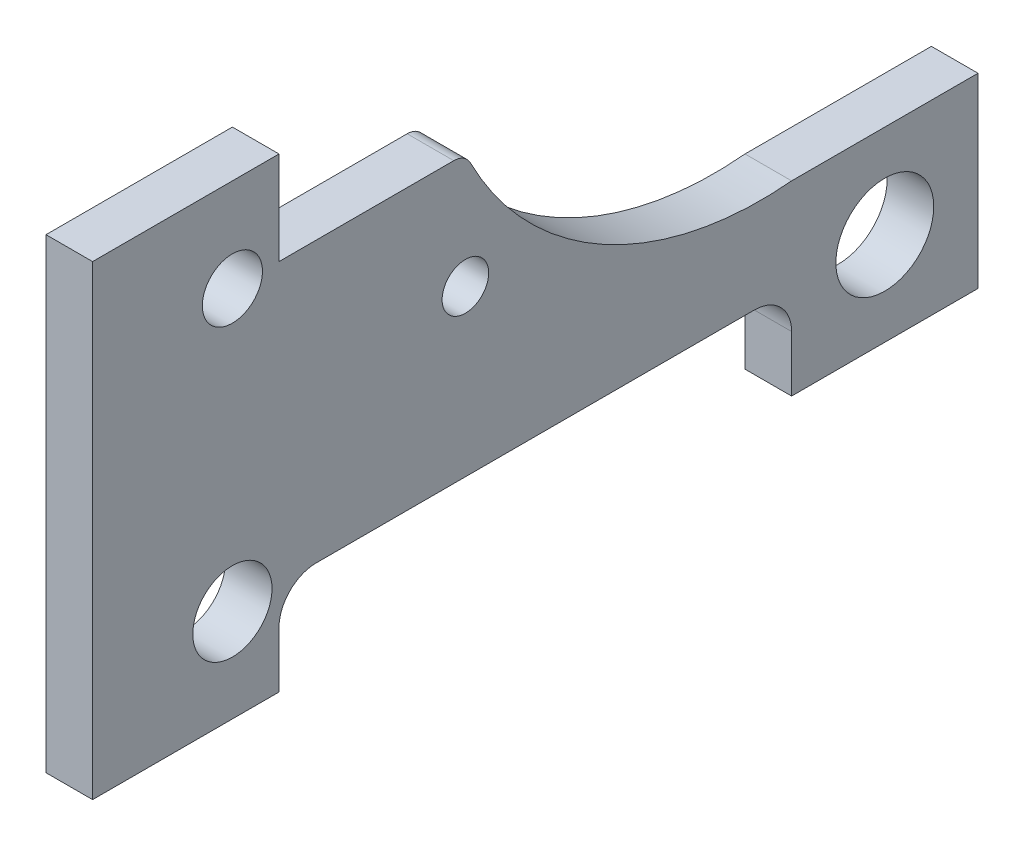
ISO-10303-21;
HEADER;
FILE_DESCRIPTION(('STEP AP214'),'2;1');
FILE_NAME('part.step','',(''),(''),'','','');
FILE_SCHEMA(('AUTOMOTIVE_DESIGN { 1 0 10303 214 1 1 1 1 }'));
ENDSEC;
DATA;
#1=APPLICATION_CONTEXT('core data for automotive mechanical design processes');
#2=APPLICATION_PROTOCOL_DEFINITION('international standard','automotive_design',2000,#1);
#3=PRODUCT_CONTEXT('',#1,'mechanical');
#4=PRODUCT('Part','Part','',(#3));
#5=PRODUCT_RELATED_PRODUCT_CATEGORY('part','',(#4));
#6=PRODUCT_DEFINITION_FORMATION('','',#4);
#7=PRODUCT_DEFINITION_CONTEXT('part definition',#1,'design');
#8=PRODUCT_DEFINITION('design','',#6,#7);
#9=PRODUCT_DEFINITION_SHAPE('','',#8);
#10=(LENGTH_UNIT() NAMED_UNIT(*) SI_UNIT(.MILLI.,.METRE.));
#11=(NAMED_UNIT(*) PLANE_ANGLE_UNIT() SI_UNIT($,.RADIAN.));
#12=(NAMED_UNIT(*) SI_UNIT($,.STERADIAN.) SOLID_ANGLE_UNIT());
#13=UNCERTAINTY_MEASURE_WITH_UNIT(LENGTH_MEASURE(1.E-05),#10,'distance_accuracy_value','');
#14=(GEOMETRIC_REPRESENTATION_CONTEXT(3) GLOBAL_UNCERTAINTY_ASSIGNED_CONTEXT((#13)) GLOBAL_UNIT_ASSIGNED_CONTEXT((#10,
#11,#12)) REPRESENTATION_CONTEXT('',''));
#15=CARTESIAN_POINT('',(0.,0.,0.));
#16=DIRECTION('',(0.,0.,1.));
#17=DIRECTION('',(1.,0.,0.));
#18=AXIS2_PLACEMENT_3D('',#15,#16,#17);
#19=CARTESIAN_POINT('',(5.,54.8437424407342,-71.6964242518481));
#20=DIRECTION('',(1.,0.,0.));
#21=DIRECTION('',(0.,0.,-1.));
#22=AXIS2_PLACEMENT_3D('',#19,#20,#21);
#23=PLANE('',#22);
#24=CARTESIAN_POINT('',(5.,27.7000519533061,-40.));
#25=DIRECTION('',(1.,0.,0.));
#26=DIRECTION('',(0.,0.,-1.));
#27=AXIS2_PLACEMENT_3D('',#24,#25,#26);
#28=CIRCLE('',#27,2.5);
#29=CARTESIAN_POINT('',(5.,27.7000519533061,-42.5));
#30=VERTEX_POINT('',#29);
#31=EDGE_CURVE('E494',#30,#30,#28,.T.);
#32=ORIENTED_EDGE('',*,*,#31,.F.);
#33=EDGE_LOOP('',(#32));
#34=FACE_BOUND('',#33,.T.);
#35=CARTESIAN_POINT('',(5.,40.,-15.));
#36=DIRECTION('',(1.,0.,0.));
#37=DIRECTION('',(0.,0.,-1.));
#38=AXIS2_PLACEMENT_3D('',#35,#36,#37);
#39=CIRCLE('',#38,3.225);
#40=CARTESIAN_POINT('',(5.,40.,-18.225));
#41=VERTEX_POINT('',#40);
#42=EDGE_CURVE('E270',#41,#41,#39,.T.);
#43=ORIENTED_EDGE('',*,*,#42,.F.);
#44=EDGE_LOOP('',(#43));
#45=FACE_BOUND('',#44,.T.);
#46=CARTESIAN_POINT('',(5.,54.8437424407342,-71.6964242518481));
#47=DIRECTION('',(-1.,0.,0.));
#48=DIRECTION('',(0.,0.,-1.));
#49=AXIS2_PLACEMENT_3D('',#46,#47,#48);
#50=CIRCLE('',#49,35.);
#51=CARTESIAN_POINT('',(5.,20.,-75.));
#52=VERTEX_POINT('',#51);
#53=CARTESIAN_POINT('',(5.,38.910472564364,-40.5334508531695));
#54=VERTEX_POINT('',#53);
#55=EDGE_CURVE('E257',#52,#54,#50,.T.);
#56=ORIENTED_EDGE('',*,*,#55,.T.);
#57=CARTESIAN_POINT('',(5.,38.,-38.7527095161021));
#58=DIRECTION('',(1.,0.,0.));
#59=DIRECTION('',(0.,0.,-1.));
#60=AXIS2_PLACEMENT_3D('',#57,#58,#59);
#61=CIRCLE('',#60,2.);
#62=CARTESIAN_POINT('',(5.,40.,-38.7527095161021));
#63=VERTEX_POINT('',#62);
#64=EDGE_CURVE('E11',#54,#63,#61,.T.);
#65=ORIENTED_EDGE('',*,*,#64,.T.);
#66=DIRECTION('',(0.,0.,1.));
#67=VECTOR('',#66,1.);
#68=CARTESIAN_POINT('',(5.,40.,-20.));
#69=LINE('',#68,#67);
#70=CARTESIAN_POINT('',(5.,40.,-20.));
#71=VERTEX_POINT('',#70);
#72=EDGE_CURVE('E199',#63,#71,#69,.T.);
#73=ORIENTED_EDGE('',*,*,#72,.T.);
#74=DIRECTION('',(0.,1.,0.));
#75=VECTOR('',#74,1.);
#76=CARTESIAN_POINT('',(5.,50.,-20.));
#77=LINE('',#76,#75);
#78=CARTESIAN_POINT('',(5.,50.,-20.));
#79=VERTEX_POINT('',#78);
#80=EDGE_CURVE('E260',#71,#79,#77,.T.);
#81=ORIENTED_EDGE('',*,*,#80,.T.);
#82=DIRECTION('',(0.,0.,1.));
#83=VECTOR('',#82,1.);
#84=CARTESIAN_POINT('',(5.,50.,0.));
#85=LINE('',#84,#83);
#86=CARTESIAN_POINT('',(5.,50.,0.));
#87=VERTEX_POINT('',#86);
#88=EDGE_CURVE('E157',#79,#87,#85,.T.);
#89=ORIENTED_EDGE('',*,*,#88,.T.);
#90=DIRECTION('',(0.,-1.,0.));
#91=VECTOR('',#90,1.);
#92=CARTESIAN_POINT('',(5.,0.,0.));
#93=LINE('',#92,#91);
#94=CARTESIAN_POINT('',(5.,0.,0.));
#95=VERTEX_POINT('',#94);
#96=EDGE_CURVE('E152',#87,#95,#93,.T.);
#97=ORIENTED_EDGE('',*,*,#96,.T.);
#98=DIRECTION('',(0.,0.,-1.));
#99=VECTOR('',#98,1.);
#100=CARTESIAN_POINT('',(5.,0.,0.));
#101=LINE('',#100,#99);
#102=CARTESIAN_POINT('',(5.,0.,-20.));
#103=VERTEX_POINT('',#102);
#104=EDGE_CURVE('E140',#95,#103,#101,.T.);
#105=ORIENTED_EDGE('',*,*,#104,.T.);
#106=DIRECTION('',(0.,1.,0.));
#107=VECTOR('',#106,1.);
#108=CARTESIAN_POINT('',(5.,0.,-20.));
#109=LINE('',#108,#107);
#110=CARTESIAN_POINT('',(5.,5.99999999999999,-20.));
#111=VERTEX_POINT('',#110);
#112=EDGE_CURVE('E151',#103,#111,#109,.T.);
#113=ORIENTED_EDGE('',*,*,#112,.T.);
#114=CARTESIAN_POINT('',(5.,6.,-24.));
#115=DIRECTION('',(1.,0.,0.));
#116=DIRECTION('',(0.,0.,-1.));
#117=AXIS2_PLACEMENT_3D('',#114,#115,#116);
#118=CIRCLE('',#117,4.);
#119=CARTESIAN_POINT('',(5.,10.,-24.));
#120=VERTEX_POINT('',#119);
#121=EDGE_CURVE('E187',#111,#120,#118,.F.);
#122=ORIENTED_EDGE('',*,*,#121,.T.);
#123=DIRECTION('',(0.,0.,-1.));
#124=VECTOR('',#123,1.);
#125=CARTESIAN_POINT('',(5.,10.,-20.));
#126=LINE('',#125,#124);
#127=CARTESIAN_POINT('',(5.,10.,-71.));
#128=VERTEX_POINT('',#127);
#129=EDGE_CURVE('E287',#120,#128,#126,.T.);
#130=ORIENTED_EDGE('',*,*,#129,.T.);
#131=CARTESIAN_POINT('',(5.,6.,-71.));
#132=DIRECTION('',(1.,0.,0.));
#133=DIRECTION('',(0.,0.,-1.));
#134=AXIS2_PLACEMENT_3D('',#131,#132,#133);
#135=CIRCLE('',#134,4.);
#136=CARTESIAN_POINT('',(5.,6.,-75.));
#137=VERTEX_POINT('',#136);
#138=EDGE_CURVE('E183',#128,#137,#135,.F.);
#139=ORIENTED_EDGE('',*,*,#138,.T.);
#140=DIRECTION('',(0.,-1.,0.));
#141=VECTOR('',#140,1.);
#142=CARTESIAN_POINT('',(5.,10.,-75.));
#143=LINE('',#142,#141);
#144=CARTESIAN_POINT('',(5.,0.,-75.));
#145=VERTEX_POINT('',#144);
#146=EDGE_CURVE('E286',#137,#145,#143,.T.);
#147=ORIENTED_EDGE('',*,*,#146,.T.);
#148=DIRECTION('',(0.,0.,-1.));
#149=VECTOR('',#148,1.);
#150=CARTESIAN_POINT('',(5.,0.,-75.));
#151=LINE('',#150,#149);
#152=CARTESIAN_POINT('',(5.,0.,-95.));
#153=VERTEX_POINT('',#152);
#154=EDGE_CURVE('E238',#145,#153,#151,.T.);
#155=ORIENTED_EDGE('',*,*,#154,.T.);
#156=DIRECTION('',(0.,1.,0.));
#157=VECTOR('',#156,1.);
#158=CARTESIAN_POINT('',(5.,0.,-95.));
#159=LINE('',#158,#157);
#160=CARTESIAN_POINT('',(5.,20.,-95.));
#161=VERTEX_POINT('',#160);
#162=EDGE_CURVE('E262',#153,#161,#159,.T.);
#163=ORIENTED_EDGE('',*,*,#162,.T.);
#164=DIRECTION('',(0.,0.,1.));
#165=VECTOR('',#164,1.);
#166=CARTESIAN_POINT('',(5.,20.,-95.));
#167=LINE('',#166,#165);
#168=EDGE_CURVE('E258',#161,#52,#167,.T.);
#169=ORIENTED_EDGE('',*,*,#168,.T.);
#170=EDGE_LOOP('',(#56,#65,#73,#81,#89,#97,#105,#113,#122,#130,#139,#147,#155,#163,#169));
#171=FACE_BOUND('',#170,.T.);
#172=CARTESIAN_POINT('',(5.,10.,-15.));
#173=DIRECTION('',(1.,0.,0.));
#174=DIRECTION('',(0.,0.,-1.));
#175=AXIS2_PLACEMENT_3D('',#172,#173,#174);
#176=CIRCLE('',#175,4.25);
#177=CARTESIAN_POINT('',(5.,10.,-19.25));
#178=VERTEX_POINT('',#177);
#179=EDGE_CURVE('E488',#178,#178,#176,.T.);
#180=ORIENTED_EDGE('',*,*,#179,.F.);
#181=EDGE_LOOP('',(#180));
#182=FACE_BOUND('',#181,.T.);
#183=CARTESIAN_POINT('',(5.,10.,-85.));
#184=DIRECTION('',(1.,0.,0.));
#185=DIRECTION('',(0.,0.,-1.));
#186=AXIS2_PLACEMENT_3D('',#183,#184,#185);
#187=CIRCLE('',#186,5.25);
#188=CARTESIAN_POINT('',(5.,10.,-90.25));
#189=VERTEX_POINT('',#188);
#190=EDGE_CURVE('E500',#189,#189,#187,.T.);
#191=ORIENTED_EDGE('',*,*,#190,.F.);
#192=EDGE_LOOP('',(#191));
#193=FACE_BOUND('',#192,.T.);
#194=ADVANCED_FACE('F33',(#34,#45,#171,#182,#193),#23,.T.);
#195=CARTESIAN_POINT('',(0.,54.8437424407342,-71.6964242518481));
#196=DIRECTION('',(1.,0.,0.));
#197=DIRECTION('',(0.,0.,-1.));
#198=AXIS2_PLACEMENT_3D('',#195,#196,#197);
#199=PLANE('',#198);
#200=DIRECTION('',(0.,0.,1.));
#201=VECTOR('',#200,1.);
#202=CARTESIAN_POINT('',(0.,40.,-20.));
#203=LINE('',#202,#201);
#204=CARTESIAN_POINT('',(0.,40.,-38.7527095161021));
#205=VERTEX_POINT('',#204);
#206=CARTESIAN_POINT('',(0.,40.,-20.));
#207=VERTEX_POINT('',#206);
#208=EDGE_CURVE('E197',#205,#207,#203,.T.);
#209=ORIENTED_EDGE('',*,*,#208,.F.);
#210=CARTESIAN_POINT('',(0.,38.,-38.7527095161021));
#211=DIRECTION('',(1.,0.,0.));
#212=DIRECTION('',(0.,0.,-1.));
#213=AXIS2_PLACEMENT_3D('',#210,#211,#212);
#214=CIRCLE('',#213,2.);
#215=CARTESIAN_POINT('',(0.,38.910472564364,-40.5334508531695));
#216=VERTEX_POINT('',#215);
#217=EDGE_CURVE('E55',#205,#216,#214,.F.);
#218=ORIENTED_EDGE('',*,*,#217,.T.);
#219=CARTESIAN_POINT('',(0.,54.8437424407342,-71.6964242518481));
#220=DIRECTION('',(-1.,0.,0.));
#221=DIRECTION('',(0.,0.,-1.));
#222=AXIS2_PLACEMENT_3D('',#219,#220,#221);
#223=CIRCLE('',#222,35.);
#224=CARTESIAN_POINT('',(0.,20.,-75.));
#225=VERTEX_POINT('',#224);
#226=EDGE_CURVE('E207',#225,#216,#223,.T.);
#227=ORIENTED_EDGE('',*,*,#226,.F.);
#228=DIRECTION('',(0.,0.,1.));
#229=VECTOR('',#228,1.);
#230=CARTESIAN_POINT('',(0.,20.,-95.));
#231=LINE('',#230,#229);
#232=CARTESIAN_POINT('',(0.,20.,-95.));
#233=VERTEX_POINT('',#232);
#234=EDGE_CURVE('E210',#233,#225,#231,.T.);
#235=ORIENTED_EDGE('',*,*,#234,.F.);
#236=DIRECTION('',(0.,1.,0.));
#237=VECTOR('',#236,1.);
#238=CARTESIAN_POINT('',(0.,0.,-95.));
#239=LINE('',#238,#237);
#240=CARTESIAN_POINT('',(0.,0.,-95.));
#241=VERTEX_POINT('',#240);
#242=EDGE_CURVE('E245',#241,#233,#239,.T.);
#243=ORIENTED_EDGE('',*,*,#242,.F.);
#244=DIRECTION('',(0.,0.,-1.));
#245=VECTOR('',#244,1.);
#246=CARTESIAN_POINT('',(0.,0.,-75.));
#247=LINE('',#246,#245);
#248=CARTESIAN_POINT('',(0.,0.,-75.));
#249=VERTEX_POINT('',#248);
#250=EDGE_CURVE('E237',#249,#241,#247,.T.);
#251=ORIENTED_EDGE('',*,*,#250,.F.);
#252=DIRECTION('',(0.,-1.,0.));
#253=VECTOR('',#252,1.);
#254=CARTESIAN_POINT('',(0.,10.,-75.));
#255=LINE('',#254,#253);
#256=CARTESIAN_POINT('',(0.,6.,-75.));
#257=VERTEX_POINT('',#256);
#258=EDGE_CURVE('E243',#257,#249,#255,.T.);
#259=ORIENTED_EDGE('',*,*,#258,.F.);
#260=CARTESIAN_POINT('',(0.,6.,-71.));
#261=DIRECTION('',(1.,0.,0.));
#262=DIRECTION('',(0.,0.,-1.));
#263=AXIS2_PLACEMENT_3D('',#260,#261,#262);
#264=CIRCLE('',#263,4.);
#265=CARTESIAN_POINT('',(0.,10.,-71.));
#266=VERTEX_POINT('',#265);
#267=EDGE_CURVE('E181',#257,#266,#264,.T.);
#268=ORIENTED_EDGE('',*,*,#267,.T.);
#269=DIRECTION('',(0.,0.,-1.));
#270=VECTOR('',#269,1.);
#271=CARTESIAN_POINT('',(0.,10.,-20.));
#272=LINE('',#271,#270);
#273=CARTESIAN_POINT('',(0.,10.,-24.));
#274=VERTEX_POINT('',#273);
#275=EDGE_CURVE('E248',#274,#266,#272,.T.);
#276=ORIENTED_EDGE('',*,*,#275,.F.);
#277=CARTESIAN_POINT('',(0.,6.,-24.));
#278=DIRECTION('',(1.,0.,0.));
#279=DIRECTION('',(0.,0.,-1.));
#280=AXIS2_PLACEMENT_3D('',#277,#278,#279);
#281=CIRCLE('',#280,4.);
#282=CARTESIAN_POINT('',(0.,5.99999999999999,-20.));
#283=VERTEX_POINT('',#282);
#284=EDGE_CURVE('E185',#274,#283,#281,.T.);
#285=ORIENTED_EDGE('',*,*,#284,.T.);
#286=DIRECTION('',(0.,1.,0.));
#287=VECTOR('',#286,1.);
#288=CARTESIAN_POINT('',(0.,0.,-20.));
#289=LINE('',#288,#287);
#290=CARTESIAN_POINT('',(0.,0.,-20.));
#291=VERTEX_POINT('',#290);
#292=EDGE_CURVE('E272',#291,#283,#289,.T.);
#293=ORIENTED_EDGE('',*,*,#292,.F.);
#294=DIRECTION('',(0.,0.,-1.));
#295=VECTOR('',#294,1.);
#296=CARTESIAN_POINT('',(0.,0.,0.));
#297=LINE('',#296,#295);
#298=CARTESIAN_POINT('',(0.,0.,0.));
#299=VERTEX_POINT('',#298);
#300=EDGE_CURVE('E269',#299,#291,#297,.T.);
#301=ORIENTED_EDGE('',*,*,#300,.F.);
#302=DIRECTION('',(0.,-1.,0.));
#303=VECTOR('',#302,1.);
#304=CARTESIAN_POINT('',(0.,0.,0.));
#305=LINE('',#304,#303);
#306=CARTESIAN_POINT('',(0.,50.,0.));
#307=VERTEX_POINT('',#306);
#308=EDGE_CURVE('E165',#307,#299,#305,.T.);
#309=ORIENTED_EDGE('',*,*,#308,.F.);
#310=DIRECTION('',(0.,0.,1.));
#311=VECTOR('',#310,1.);
#312=CARTESIAN_POINT('',(0.,50.,0.));
#313=LINE('',#312,#311);
#314=CARTESIAN_POINT('',(0.,50.,-20.));
#315=VERTEX_POINT('',#314);
#316=EDGE_CURVE('E161',#315,#307,#313,.T.);
#317=ORIENTED_EDGE('',*,*,#316,.F.);
#318=DIRECTION('',(0.,1.,0.));
#319=VECTOR('',#318,1.);
#320=CARTESIAN_POINT('',(0.,50.,-20.));
#321=LINE('',#320,#319);
#322=EDGE_CURVE('E206',#207,#315,#321,.T.);
#323=ORIENTED_EDGE('',*,*,#322,.F.);
#324=EDGE_LOOP('',(#209,#218,#227,#235,#243,#251,#259,#268,#276,#285,#293,#301,#309,#317,#323));
#325=FACE_BOUND('',#324,.T.);
#326=CARTESIAN_POINT('',(0.,40.,-15.));
#327=DIRECTION('',(1.,0.,0.));
#328=DIRECTION('',(0.,0.,-1.));
#329=AXIS2_PLACEMENT_3D('',#326,#327,#328);
#330=CIRCLE('',#329,3.225);
#331=CARTESIAN_POINT('',(0.,40.,-18.225));
#332=VERTEX_POINT('',#331);
#333=EDGE_CURVE('E485',#332,#332,#330,.T.);
#334=ORIENTED_EDGE('',*,*,#333,.T.);
#335=EDGE_LOOP('',(#334));
#336=FACE_BOUND('',#335,.T.);
#337=CARTESIAN_POINT('',(0.,10.,-15.));
#338=DIRECTION('',(1.,0.,0.));
#339=DIRECTION('',(0.,0.,-1.));
#340=AXIS2_PLACEMENT_3D('',#337,#338,#339);
#341=CIRCLE('',#340,4.25);
#342=CARTESIAN_POINT('',(0.,10.,-19.25));
#343=VERTEX_POINT('',#342);
#344=EDGE_CURVE('E491',#343,#343,#341,.T.);
#345=ORIENTED_EDGE('',*,*,#344,.T.);
#346=EDGE_LOOP('',(#345));
#347=FACE_BOUND('',#346,.T.);
#348=CARTESIAN_POINT('',(0.,27.7000519533061,-40.));
#349=DIRECTION('',(1.,0.,0.));
#350=DIRECTION('',(0.,0.,-1.));
#351=AXIS2_PLACEMENT_3D('',#348,#349,#350);
#352=CIRCLE('',#351,2.5);
#353=CARTESIAN_POINT('',(0.,27.7000519533061,-42.5));
#354=VERTEX_POINT('',#353);
#355=EDGE_CURVE('E497',#354,#354,#352,.T.);
#356=ORIENTED_EDGE('',*,*,#355,.T.);
#357=EDGE_LOOP('',(#356));
#358=FACE_BOUND('',#357,.T.);
#359=CARTESIAN_POINT('',(0.,10.,-85.));
#360=DIRECTION('',(1.,0.,0.));
#361=DIRECTION('',(0.,0.,-1.));
#362=AXIS2_PLACEMENT_3D('',#359,#360,#361);
#363=CIRCLE('',#362,5.25);
#364=CARTESIAN_POINT('',(0.,10.,-90.25));
#365=VERTEX_POINT('',#364);
#366=EDGE_CURVE('E503',#365,#365,#363,.T.);
#367=ORIENTED_EDGE('',*,*,#366,.T.);
#368=EDGE_LOOP('',(#367));
#369=FACE_BOUND('',#368,.T.);
#370=ADVANCED_FACE('F203',(#325,#336,#347,#358,#369),#199,.F.);
#371=CARTESIAN_POINT('',(5.,0.,0.));
#372=DIRECTION('',(0.,0.,-1.));
#373=DIRECTION('',(-1.,0.,0.));
#374=AXIS2_PLACEMENT_3D('',#371,#372,#373);
#375=PLANE('',#374);
#376=ORIENTED_EDGE('',*,*,#308,.T.);
#377=DIRECTION('',(-1.,0.,0.));
#378=VECTOR('',#377,1.);
#379=CARTESIAN_POINT('',(5.,0.,0.));
#380=LINE('',#379,#378);
#381=EDGE_CURVE('E144',#95,#299,#380,.T.);
#382=ORIENTED_EDGE('',*,*,#381,.F.);
#383=ORIENTED_EDGE('',*,*,#96,.F.);
#384=DIRECTION('',(-1.,0.,0.));
#385=VECTOR('',#384,1.);
#386=CARTESIAN_POINT('',(5.,50.,0.));
#387=LINE('',#386,#385);
#388=EDGE_CURVE('E215',#87,#307,#387,.T.);
#389=ORIENTED_EDGE('',*,*,#388,.T.);
#390=EDGE_LOOP('',(#376,#382,#383,#389));
#391=FACE_BOUND('',#390,.T.);
#392=ADVANCED_FACE('F163',(#391),#375,.F.);
#393=CARTESIAN_POINT('',(5.,0.,0.));
#394=DIRECTION('',(0.,1.,0.));
#395=DIRECTION('',(0.,0.,1.));
#396=AXIS2_PLACEMENT_3D('',#393,#394,#395);
#397=PLANE('',#396);
#398=ORIENTED_EDGE('',*,*,#300,.T.);
#399=DIRECTION('',(-1.,0.,0.));
#400=VECTOR('',#399,1.);
#401=CARTESIAN_POINT('',(5.,0.,-20.));
#402=LINE('',#401,#400);
#403=EDGE_CURVE('E147',#103,#291,#402,.T.);
#404=ORIENTED_EDGE('',*,*,#403,.F.);
#405=ORIENTED_EDGE('',*,*,#104,.F.);
#406=ORIENTED_EDGE('',*,*,#381,.T.);
#407=EDGE_LOOP('',(#398,#404,#405,#406));
#408=FACE_BOUND('',#407,.T.);
#409=ADVANCED_FACE('F142',(#408),#397,.F.);
#410=CARTESIAN_POINT('',(5.,0.,-20.));
#411=DIRECTION('',(0.,0.,1.));
#412=DIRECTION('',(0.,-1.,0.));
#413=AXIS2_PLACEMENT_3D('',#410,#411,#412);
#414=PLANE('',#413);
#415=ORIENTED_EDGE('',*,*,#292,.T.);
#416=DIRECTION('',(-1.,0.,0.));
#417=VECTOR('',#416,1.);
#418=CARTESIAN_POINT('',(5.,5.99999999999999,-20.));
#419=LINE('',#418,#417);
#420=EDGE_CURVE('E179',#283,#111,#419,.F.);
#421=ORIENTED_EDGE('',*,*,#420,.T.);
#422=ORIENTED_EDGE('',*,*,#112,.F.);
#423=ORIENTED_EDGE('',*,*,#403,.T.);
#424=EDGE_LOOP('',(#415,#421,#422,#423));
#425=FACE_BOUND('',#424,.T.);
#426=ADVANCED_FACE('F444',(#425),#414,.F.);
#427=CARTESIAN_POINT('',(5.,10.,-20.));
#428=DIRECTION('',(0.,1.,0.));
#429=DIRECTION('',(0.,0.,1.));
#430=AXIS2_PLACEMENT_3D('',#427,#428,#429);
#431=PLANE('',#430);
#432=ORIENTED_EDGE('',*,*,#275,.T.);
#433=DIRECTION('',(-1.,0.,0.));
#434=VECTOR('',#433,1.);
#435=CARTESIAN_POINT('',(5.,10.,-71.));
#436=LINE('',#435,#434);
#437=EDGE_CURVE('E177',#266,#128,#436,.F.);
#438=ORIENTED_EDGE('',*,*,#437,.T.);
#439=ORIENTED_EDGE('',*,*,#129,.F.);
#440=DIRECTION('',(-1.,0.,0.));
#441=VECTOR('',#440,1.);
#442=CARTESIAN_POINT('',(0.,10.,-24.));
#443=LINE('',#442,#441);
#444=EDGE_CURVE('E169',#120,#274,#443,.T.);
#445=ORIENTED_EDGE('',*,*,#444,.T.);
#446=EDGE_LOOP('',(#432,#438,#439,#445));
#447=FACE_BOUND('',#446,.T.);
#448=ADVANCED_FACE('F278',(#447),#431,.F.);
#449=CARTESIAN_POINT('',(5.,10.,-75.));
#450=DIRECTION('',(0.,0.,-1.));
#451=DIRECTION('',(-1.,0.,0.));
#452=AXIS2_PLACEMENT_3D('',#449,#450,#451);
#453=PLANE('',#452);
#454=ORIENTED_EDGE('',*,*,#146,.F.);
#455=DIRECTION('',(-1.,0.,0.));
#456=VECTOR('',#455,1.);
#457=CARTESIAN_POINT('',(0.,6.,-75.));
#458=LINE('',#457,#456);
#459=EDGE_CURVE('E166',#137,#257,#458,.T.);
#460=ORIENTED_EDGE('',*,*,#459,.T.);
#461=ORIENTED_EDGE('',*,*,#258,.T.);
#462=DIRECTION('',(-1.,0.,0.));
#463=VECTOR('',#462,1.);
#464=CARTESIAN_POINT('',(5.,0.,-75.));
#465=LINE('',#464,#463);
#466=EDGE_CURVE('E171',#145,#249,#465,.T.);
#467=ORIENTED_EDGE('',*,*,#466,.F.);
#468=EDGE_LOOP('',(#454,#460,#461,#467));
#469=FACE_BOUND('',#468,.T.);
#470=ADVANCED_FACE('F288',(#469),#453,.F.);
#471=CARTESIAN_POINT('',(5.,0.,-75.));
#472=DIRECTION('',(0.,1.,0.));
#473=DIRECTION('',(0.,0.,1.));
#474=AXIS2_PLACEMENT_3D('',#471,#472,#473);
#475=PLANE('',#474);
#476=ORIENTED_EDGE('',*,*,#250,.T.);
#477=DIRECTION('',(-1.,0.,0.));
#478=VECTOR('',#477,1.);
#479=CARTESIAN_POINT('',(5.,0.,-95.));
#480=LINE('',#479,#478);
#481=EDGE_CURVE('E228',#153,#241,#480,.T.);
#482=ORIENTED_EDGE('',*,*,#481,.F.);
#483=ORIENTED_EDGE('',*,*,#154,.F.);
#484=ORIENTED_EDGE('',*,*,#466,.T.);
#485=EDGE_LOOP('',(#476,#482,#483,#484));
#486=FACE_BOUND('',#485,.T.);
#487=ADVANCED_FACE('F235',(#486),#475,.F.);
#488=CARTESIAN_POINT('',(5.,0.,-95.));
#489=DIRECTION('',(0.,0.,1.));
#490=DIRECTION('',(1.,0.,0.));
#491=AXIS2_PLACEMENT_3D('',#488,#489,#490);
#492=PLANE('',#491);
#493=ORIENTED_EDGE('',*,*,#242,.T.);
#494=DIRECTION('',(-1.,0.,0.));
#495=VECTOR('',#494,1.);
#496=CARTESIAN_POINT('',(5.,20.,-95.));
#497=LINE('',#496,#495);
#498=EDGE_CURVE('E225',#161,#233,#497,.T.);
#499=ORIENTED_EDGE('',*,*,#498,.F.);
#500=ORIENTED_EDGE('',*,*,#162,.F.);
#501=ORIENTED_EDGE('',*,*,#481,.T.);
#502=EDGE_LOOP('',(#493,#499,#500,#501));
#503=FACE_BOUND('',#502,.T.);
#504=ADVANCED_FACE('F295',(#503),#492,.F.);
#505=CARTESIAN_POINT('',(5.,20.,-95.));
#506=DIRECTION('',(0.,-1.,0.));
#507=DIRECTION('',(0.,0.,-1.));
#508=AXIS2_PLACEMENT_3D('',#505,#506,#507);
#509=PLANE('',#508);
#510=ORIENTED_EDGE('',*,*,#234,.T.);
#511=DIRECTION('',(-1.,0.,0.));
#512=VECTOR('',#511,1.);
#513=CARTESIAN_POINT('',(5.,20.,-75.));
#514=LINE('',#513,#512);
#515=EDGE_CURVE('E222',#52,#225,#514,.T.);
#516=ORIENTED_EDGE('',*,*,#515,.F.);
#517=ORIENTED_EDGE('',*,*,#168,.F.);
#518=ORIENTED_EDGE('',*,*,#498,.T.);
#519=EDGE_LOOP('',(#510,#516,#517,#518));
#520=FACE_BOUND('',#519,.T.);
#521=ADVANCED_FACE('F253',(#520),#509,.F.);
#522=CARTESIAN_POINT('',(5.,54.8437424407342,-71.6964242518481));
#523=DIRECTION('',(-1.,0.,0.));
#524=DIRECTION('',(0.,0.,1.));
#525=AXIS2_PLACEMENT_3D('',#522,#523,#524);
#526=CYLINDRICAL_SURFACE('',#525,35.);
#527=ORIENTED_EDGE('',*,*,#226,.T.);
#528=DIRECTION('',(-1.,0.,0.));
#529=VECTOR('',#528,1.);
#530=CARTESIAN_POINT('',(5.,38.910472564364,-40.5334508531695));
#531=LINE('',#530,#529);
#532=EDGE_CURVE('E41',#216,#54,#531,.F.);
#533=ORIENTED_EDGE('',*,*,#532,.T.);
#534=ORIENTED_EDGE('',*,*,#55,.F.);
#535=ORIENTED_EDGE('',*,*,#515,.T.);
#536=EDGE_LOOP('',(#527,#533,#534,#535));
#537=FACE_BOUND('',#536,.T.);
#538=ADVANCED_FACE('F256',(#537),#526,.F.);
#539=CARTESIAN_POINT('',(5.,40.,-20.));
#540=DIRECTION('',(0.,-1.,0.));
#541=DIRECTION('',(0.,0.,-1.));
#542=AXIS2_PLACEMENT_3D('',#539,#540,#541);
#543=PLANE('',#542);
#544=ORIENTED_EDGE('',*,*,#72,.F.);
#545=DIRECTION('',(-1.,0.,0.));
#546=VECTOR('',#545,1.);
#547=CARTESIAN_POINT('',(5.,40.,-38.7527095161021));
#548=LINE('',#547,#546);
#549=EDGE_CURVE('E189',#63,#205,#548,.T.);
#550=ORIENTED_EDGE('',*,*,#549,.T.);
#551=ORIENTED_EDGE('',*,*,#208,.T.);
#552=DIRECTION('',(-1.,0.,0.));
#553=VECTOR('',#552,1.);
#554=CARTESIAN_POINT('',(5.,40.,-20.));
#555=LINE('',#554,#553);
#556=EDGE_CURVE('E220',#71,#207,#555,.T.);
#557=ORIENTED_EDGE('',*,*,#556,.F.);
#558=EDGE_LOOP('',(#544,#550,#551,#557));
#559=FACE_BOUND('',#558,.T.);
#560=ADVANCED_FACE('F195',(#559),#543,.F.);
#561=CARTESIAN_POINT('',(5.,50.,-20.));
#562=DIRECTION('',(0.,0.,1.));
#563=DIRECTION('',(1.,0.,0.));
#564=AXIS2_PLACEMENT_3D('',#561,#562,#563);
#565=PLANE('',#564);
#566=ORIENTED_EDGE('',*,*,#322,.T.);
#567=DIRECTION('',(-1.,0.,0.));
#568=VECTOR('',#567,1.);
#569=CARTESIAN_POINT('',(5.,50.,-20.));
#570=LINE('',#569,#568);
#571=EDGE_CURVE('E217',#79,#315,#570,.T.);
#572=ORIENTED_EDGE('',*,*,#571,.F.);
#573=ORIENTED_EDGE('',*,*,#80,.F.);
#574=ORIENTED_EDGE('',*,*,#556,.T.);
#575=EDGE_LOOP('',(#566,#572,#573,#574));
#576=FACE_BOUND('',#575,.T.);
#577=ADVANCED_FACE('F320',(#576),#565,.F.);
#578=CARTESIAN_POINT('',(5.,50.,0.));
#579=DIRECTION('',(0.,-1.,0.));
#580=DIRECTION('',(0.,0.,-1.));
#581=AXIS2_PLACEMENT_3D('',#578,#579,#580);
#582=PLANE('',#581);
#583=ORIENTED_EDGE('',*,*,#316,.T.);
#584=ORIENTED_EDGE('',*,*,#388,.F.);
#585=ORIENTED_EDGE('',*,*,#88,.F.);
#586=ORIENTED_EDGE('',*,*,#571,.T.);
#587=EDGE_LOOP('',(#583,#584,#585,#586));
#588=FACE_BOUND('',#587,.T.);
#589=ADVANCED_FACE('F317',(#588),#582,.F.);
#590=CARTESIAN_POINT('',(5.,40.,-15.));
#591=DIRECTION('',(-1.,0.,0.));
#592=DIRECTION('',(0.,0.,1.));
#593=AXIS2_PLACEMENT_3D('',#590,#591,#592);
#594=CYLINDRICAL_SURFACE('',#593,3.225);
#595=ORIENTED_EDGE('',*,*,#42,.T.);
#596=EDGE_LOOP('',(#595));
#597=FACE_BOUND('',#596,.T.);
#598=ORIENTED_EDGE('',*,*,#333,.F.);
#599=EDGE_LOOP('',(#598));
#600=FACE_BOUND('',#599,.T.);
#601=ADVANCED_FACE('F314',(#597,#600),#594,.F.);
#602=CARTESIAN_POINT('',(5.,10.,-15.));
#603=DIRECTION('',(-1.,0.,0.));
#604=DIRECTION('',(0.,0.,1.));
#605=AXIS2_PLACEMENT_3D('',#602,#603,#604);
#606=CYLINDRICAL_SURFACE('',#605,4.25);
#607=ORIENTED_EDGE('',*,*,#179,.T.);
#608=EDGE_LOOP('',(#607));
#609=FACE_BOUND('',#608,.T.);
#610=ORIENTED_EDGE('',*,*,#344,.F.);
#611=EDGE_LOOP('',(#610));
#612=FACE_BOUND('',#611,.T.);
#613=ADVANCED_FACE('F352',(#609,#612),#606,.F.);
#614=CARTESIAN_POINT('',(5.,27.7000519533061,-40.));
#615=DIRECTION('',(-1.,0.,0.));
#616=DIRECTION('',(0.,0.,1.));
#617=AXIS2_PLACEMENT_3D('',#614,#615,#616);
#618=CYLINDRICAL_SURFACE('',#617,2.5);
#619=ORIENTED_EDGE('',*,*,#31,.T.);
#620=EDGE_LOOP('',(#619));
#621=FACE_BOUND('',#620,.T.);
#622=ORIENTED_EDGE('',*,*,#355,.F.);
#623=EDGE_LOOP('',(#622));
#624=FACE_BOUND('',#623,.T.);
#625=ADVANCED_FACE('F359',(#621,#624),#618,.F.);
#626=CARTESIAN_POINT('',(5.,10.,-85.));
#627=DIRECTION('',(-1.,0.,0.));
#628=DIRECTION('',(0.,0.,1.));
#629=AXIS2_PLACEMENT_3D('',#626,#627,#628);
#630=CYLINDRICAL_SURFACE('',#629,5.25);
#631=ORIENTED_EDGE('',*,*,#190,.T.);
#632=EDGE_LOOP('',(#631));
#633=FACE_BOUND('',#632,.T.);
#634=ORIENTED_EDGE('',*,*,#366,.F.);
#635=EDGE_LOOP('',(#634));
#636=FACE_BOUND('',#635,.T.);
#637=ADVANCED_FACE('F366',(#633,#636),#630,.F.);
#638=CARTESIAN_POINT('',(5.,6.,-71.));
#639=DIRECTION('',(1.,0.,0.));
#640=DIRECTION('',(0.,0.,-1.));
#641=AXIS2_PLACEMENT_3D('',#638,#639,#640);
#642=CYLINDRICAL_SURFACE('',#641,4.);
#643=ORIENTED_EDGE('',*,*,#138,.F.);
#644=ORIENTED_EDGE('',*,*,#437,.F.);
#645=ORIENTED_EDGE('',*,*,#267,.F.);
#646=ORIENTED_EDGE('',*,*,#459,.F.);
#647=EDGE_LOOP('',(#643,#644,#645,#646));
#648=FACE_BOUND('',#647,.T.);
#649=ADVANCED_FACE('F284',(#648),#642,.F.);
#650=CARTESIAN_POINT('',(5.,6.,-24.));
#651=DIRECTION('',(1.,0.,0.));
#652=DIRECTION('',(0.,0.,-1.));
#653=AXIS2_PLACEMENT_3D('',#650,#651,#652);
#654=CYLINDRICAL_SURFACE('',#653,4.);
#655=ORIENTED_EDGE('',*,*,#121,.F.);
#656=ORIENTED_EDGE('',*,*,#420,.F.);
#657=ORIENTED_EDGE('',*,*,#284,.F.);
#658=ORIENTED_EDGE('',*,*,#444,.F.);
#659=EDGE_LOOP('',(#655,#656,#657,#658));
#660=FACE_BOUND('',#659,.T.);
#661=ADVANCED_FACE('F382',(#660),#654,.F.);
#662=CARTESIAN_POINT('',(5.,38.,-38.7527095161021));
#663=DIRECTION('',(-1.,0.,0.));
#664=DIRECTION('',(0.,0.,1.));
#665=AXIS2_PLACEMENT_3D('',#662,#663,#664);
#666=CYLINDRICAL_SURFACE('',#665,2.);
#667=ORIENTED_EDGE('',*,*,#64,.F.);
#668=ORIENTED_EDGE('',*,*,#532,.F.);
#669=ORIENTED_EDGE('',*,*,#217,.F.);
#670=ORIENTED_EDGE('',*,*,#549,.F.);
#671=EDGE_LOOP('',(#667,#668,#669,#670));
#672=FACE_BOUND('',#671,.T.);
#673=ADVANCED_FACE('F35',(#672),#666,.T.);
#674=CLOSED_SHELL('',(#194,#370,#392,#409,#426,#448,#470,#487,#504,#521,#538,#560,#577,#589,
#601,#613,#625,#637,#649,#661,#673));
#675=MANIFOLD_SOLID_BREP('B2',#674);
#676=ADVANCED_BREP_SHAPE_REPRESENTATION('',(#18,#675),#14);
#677=SHAPE_DEFINITION_REPRESENTATION(#9,#676);
ENDSEC;
END-ISO-10303-21;
